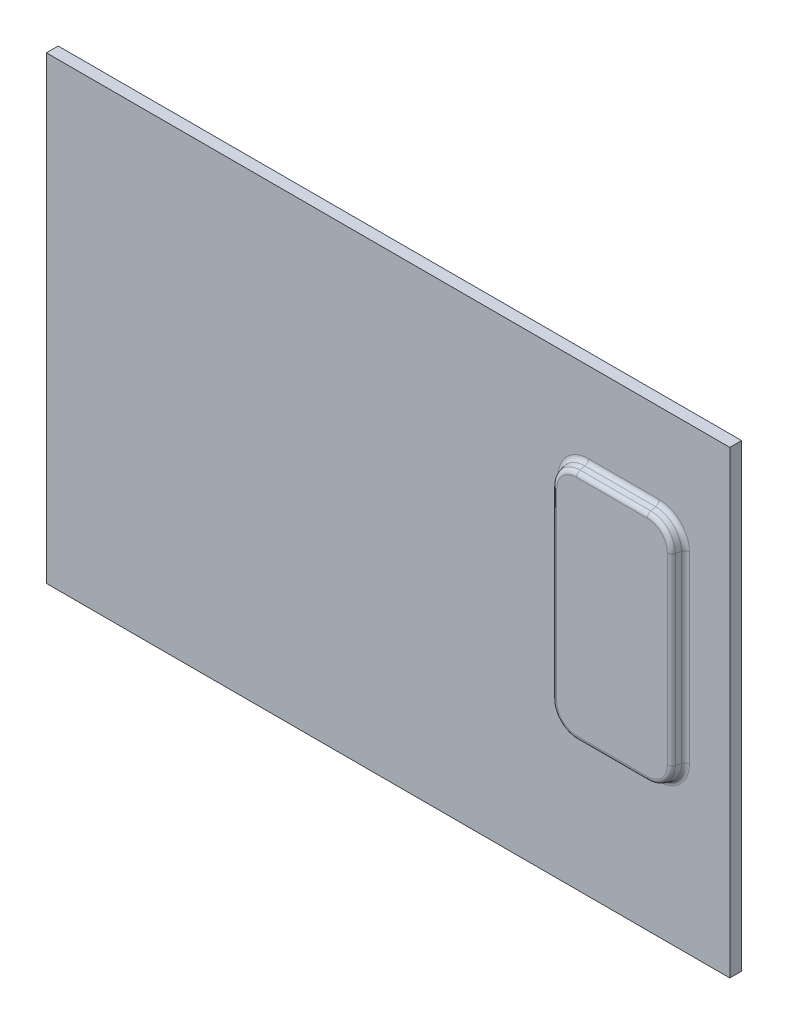
ISO-10303-21;
HEADER;
FILE_DESCRIPTION(('STEP AP214'),'2;1');
FILE_NAME('part.step','',(''),(''),'','','');
FILE_SCHEMA(('AUTOMOTIVE_DESIGN { 1 0 10303 214 1 1 1 1 }'));
ENDSEC;
DATA;
#1=APPLICATION_CONTEXT('core data for automotive mechanical design processes');
#2=APPLICATION_PROTOCOL_DEFINITION('international standard','automotive_design',2000,#1);
#3=PRODUCT_CONTEXT('',#1,'mechanical');
#4=PRODUCT('Part','Part','',(#3));
#5=PRODUCT_RELATED_PRODUCT_CATEGORY('part','',(#4));
#6=PRODUCT_DEFINITION_FORMATION('','',#4);
#7=PRODUCT_DEFINITION_CONTEXT('part definition',#1,'design');
#8=PRODUCT_DEFINITION('design','',#6,#7);
#9=PRODUCT_DEFINITION_SHAPE('','',#8);
#10=(LENGTH_UNIT() NAMED_UNIT(*) SI_UNIT(.MILLI.,.METRE.));
#11=(NAMED_UNIT(*) PLANE_ANGLE_UNIT() SI_UNIT($,.RADIAN.));
#12=(NAMED_UNIT(*) SI_UNIT($,.STERADIAN.) SOLID_ANGLE_UNIT());
#13=UNCERTAINTY_MEASURE_WITH_UNIT(LENGTH_MEASURE(1.E-05),#10,'distance_accuracy_value','');
#14=(GEOMETRIC_REPRESENTATION_CONTEXT(3) GLOBAL_UNCERTAINTY_ASSIGNED_CONTEXT((#13)) GLOBAL_UNIT_ASSIGNED_CONTEXT((#10,
#11,#12)) REPRESENTATION_CONTEXT('',''));
#15=CARTESIAN_POINT('',(0.,0.,0.));
#16=DIRECTION('',(0.,0.,1.));
#17=DIRECTION('',(1.,0.,0.));
#18=AXIS2_PLACEMENT_3D('',#15,#16,#17);
#19=CARTESIAN_POINT('',(0.,0.,5.));
#20=DIRECTION('',(0.,0.,1.));
#21=DIRECTION('',(1.,0.,0.));
#22=AXIS2_PLACEMENT_3D('',#19,#20,#21);
#23=PLANE('',#22);
#24=DIRECTION('',(0.,-1.,0.));
#25=VECTOR('',#24,1.);
#26=CARTESIAN_POINT('',(127.874399938114,0.,5.));
#27=LINE('',#26,#25);
#28=CARTESIAN_POINT('',(127.874399938114,50.5,5.));
#29=VERTEX_POINT('',#28);
#30=CARTESIAN_POINT('',(127.874399938114,-27.5,5.));
#31=VERTEX_POINT('',#30);
#32=EDGE_CURVE('E229',#29,#31,#27,.T.);
#33=ORIENTED_EDGE('',*,*,#32,.T.);
#34=CARTESIAN_POINT('',(115.,-27.5,5.));
#35=DIRECTION('',(0.,0.,1.));
#36=DIRECTION('',(1.,0.,0.));
#37=AXIS2_PLACEMENT_3D('',#34,#35,#36);
#38=CIRCLE('',#37,12.8743999381135);
#39=CARTESIAN_POINT('',(115.,-40.3743999381135,5.));
#40=VERTEX_POINT('',#39);
#41=EDGE_CURVE('E243',#31,#40,#38,.F.);
#42=ORIENTED_EDGE('',*,*,#41,.T.);
#43=DIRECTION('',(-1.,0.,0.));
#44=VECTOR('',#43,1.);
#45=CARTESIAN_POINT('',(0.,-40.3743999381135,5.));
#46=LINE('',#45,#44);
#47=CARTESIAN_POINT('',(85.0000000000001,-40.3743999381135,5.));
#48=VERTEX_POINT('',#47);
#49=EDGE_CURVE('E241',#40,#48,#46,.T.);
#50=ORIENTED_EDGE('',*,*,#49,.T.);
#51=CARTESIAN_POINT('',(85.0000000000001,-27.5,5.));
#52=DIRECTION('',(0.,0.,1.));
#53=DIRECTION('',(1.,0.,0.));
#54=AXIS2_PLACEMENT_3D('',#51,#52,#53);
#55=CIRCLE('',#54,12.8743999381135);
#56=CARTESIAN_POINT('',(72.1256000618865,-27.5,5.));
#57=VERTEX_POINT('',#56);
#58=EDGE_CURVE('E239',#48,#57,#55,.F.);
#59=ORIENTED_EDGE('',*,*,#58,.T.);
#60=DIRECTION('',(0.,1.,0.));
#61=VECTOR('',#60,1.);
#62=CARTESIAN_POINT('',(72.1256000618865,0.,5.));
#63=LINE('',#62,#61);
#64=CARTESIAN_POINT('',(72.1256000618865,50.5,5.));
#65=VERTEX_POINT('',#64);
#66=EDGE_CURVE('E237',#57,#65,#63,.T.);
#67=ORIENTED_EDGE('',*,*,#66,.T.);
#68=CARTESIAN_POINT('',(85.0000000000001,50.5,5.));
#69=DIRECTION('',(0.,0.,1.));
#70=DIRECTION('',(1.,0.,0.));
#71=AXIS2_PLACEMENT_3D('',#68,#69,#70);
#72=CIRCLE('',#71,12.8743999381135);
#73=CARTESIAN_POINT('',(85.0000000000001,63.3743999381136,5.));
#74=VERTEX_POINT('',#73);
#75=EDGE_CURVE('E235',#65,#74,#72,.F.);
#76=ORIENTED_EDGE('',*,*,#75,.T.);
#77=DIRECTION('',(1.,0.,0.));
#78=VECTOR('',#77,1.);
#79=CARTESIAN_POINT('',(0.,63.3743999381136,5.));
#80=LINE('',#79,#78);
#81=CARTESIAN_POINT('',(115.,63.3743999381136,5.));
#82=VERTEX_POINT('',#81);
#83=EDGE_CURVE('E233',#74,#82,#80,.T.);
#84=ORIENTED_EDGE('',*,*,#83,.T.);
#85=CARTESIAN_POINT('',(115.,50.5,5.));
#86=DIRECTION('',(0.,0.,1.));
#87=DIRECTION('',(1.,0.,0.));
#88=AXIS2_PLACEMENT_3D('',#85,#86,#87);
#89=CIRCLE('',#88,12.8743999381135);
#90=EDGE_CURVE('E231',#82,#29,#89,.F.);
#91=ORIENTED_EDGE('',*,*,#90,.T.);
#92=EDGE_LOOP('',(#33,#42,#50,#59,#67,#76,#84,#91));
#93=FACE_BOUND('',#92,.T.);
#94=DIRECTION('',(0.,-1.,0.));
#95=VECTOR('',#94,1.);
#96=CARTESIAN_POINT('',(-145.,-97.5,5.));
#97=LINE('',#96,#95);
#98=CARTESIAN_POINT('',(-145.,97.5,5.));
#99=VERTEX_POINT('',#98);
#100=CARTESIAN_POINT('',(-145.,-97.5,5.));
#101=VERTEX_POINT('',#100);
#102=EDGE_CURVE('E187',#99,#101,#97,.T.);
#103=ORIENTED_EDGE('',*,*,#102,.T.);
#104=DIRECTION('',(1.,0.,0.));
#105=VECTOR('',#104,1.);
#106=CARTESIAN_POINT('',(145.,-97.5,5.));
#107=LINE('',#106,#105);
#108=CARTESIAN_POINT('',(145.,-97.5,5.));
#109=VERTEX_POINT('',#108);
#110=EDGE_CURVE('E176',#101,#109,#107,.T.);
#111=ORIENTED_EDGE('',*,*,#110,.T.);
#112=DIRECTION('',(0.,1.,0.));
#113=VECTOR('',#112,1.);
#114=CARTESIAN_POINT('',(145.,-97.5,5.));
#115=LINE('',#114,#113);
#116=CARTESIAN_POINT('',(145.,97.5,5.));
#117=VERTEX_POINT('',#116);
#118=EDGE_CURVE('E186',#109,#117,#115,.T.);
#119=ORIENTED_EDGE('',*,*,#118,.T.);
#120=DIRECTION('',(-1.,0.,0.));
#121=VECTOR('',#120,1.);
#122=CARTESIAN_POINT('',(145.,97.5,5.));
#123=LINE('',#122,#121);
#124=EDGE_CURVE('E191',#117,#99,#123,.T.);
#125=ORIENTED_EDGE('',*,*,#124,.T.);
#126=EDGE_LOOP('',(#103,#111,#119,#125));
#127=FACE_BOUND('',#126,.T.);
#128=ADVANCED_FACE('F38',(#93,#127),#23,.T.);
#129=CARTESIAN_POINT('',(-145.,-97.5,5.));
#130=DIRECTION('',(1.,0.,0.));
#131=DIRECTION('',(0.,0.,-1.));
#132=AXIS2_PLACEMENT_3D('',#129,#130,#131);
#133=PLANE('',#132);
#134=DIRECTION('',(0.,-1.,0.));
#135=VECTOR('',#134,1.);
#136=CARTESIAN_POINT('',(-145.,-97.5,0.));
#137=LINE('',#136,#135);
#138=CARTESIAN_POINT('',(-145.,97.5,0.));
#139=VERTEX_POINT('',#138);
#140=CARTESIAN_POINT('',(-145.,-97.5,0.));
#141=VERTEX_POINT('',#140);
#142=EDGE_CURVE('E199',#139,#141,#137,.T.);
#143=ORIENTED_EDGE('',*,*,#142,.T.);
#144=DIRECTION('',(0.,0.,-1.));
#145=VECTOR('',#144,1.);
#146=CARTESIAN_POINT('',(-145.,-97.5,5.));
#147=LINE('',#146,#145);
#148=EDGE_CURVE('E180',#101,#141,#147,.T.);
#149=ORIENTED_EDGE('',*,*,#148,.F.);
#150=ORIENTED_EDGE('',*,*,#102,.F.);
#151=DIRECTION('',(0.,0.,-1.));
#152=VECTOR('',#151,1.);
#153=CARTESIAN_POINT('',(-145.,97.5,5.));
#154=LINE('',#153,#152);
#155=EDGE_CURVE('E753',#99,#139,#154,.T.);
#156=ORIENTED_EDGE('',*,*,#155,.T.);
#157=EDGE_LOOP('',(#143,#149,#150,#156));
#158=FACE_BOUND('',#157,.T.);
#159=ADVANCED_FACE('F197',(#158),#133,.F.);
#160=CARTESIAN_POINT('',(145.,-97.5,5.));
#161=DIRECTION('',(0.,1.,0.));
#162=DIRECTION('',(-1.,0.,0.));
#163=AXIS2_PLACEMENT_3D('',#160,#161,#162);
#164=PLANE('',#163);
#165=DIRECTION('',(1.,0.,0.));
#166=VECTOR('',#165,1.);
#167=CARTESIAN_POINT('',(145.,-97.5,0.));
#168=LINE('',#167,#166);
#169=CARTESIAN_POINT('',(145.,-97.5,0.));
#170=VERTEX_POINT('',#169);
#171=EDGE_CURVE('E751',#141,#170,#168,.T.);
#172=ORIENTED_EDGE('',*,*,#171,.T.);
#173=DIRECTION('',(0.,0.,-1.));
#174=VECTOR('',#173,1.);
#175=CARTESIAN_POINT('',(145.,-97.5,5.));
#176=LINE('',#175,#174);
#177=EDGE_CURVE('E183',#109,#170,#176,.T.);
#178=ORIENTED_EDGE('',*,*,#177,.F.);
#179=ORIENTED_EDGE('',*,*,#110,.F.);
#180=ORIENTED_EDGE('',*,*,#148,.T.);
#181=EDGE_LOOP('',(#172,#178,#179,#180));
#182=FACE_BOUND('',#181,.T.);
#183=ADVANCED_FACE('F178',(#182),#164,.F.);
#184=CARTESIAN_POINT('',(145.,-97.5,5.));
#185=DIRECTION('',(-1.,0.,0.));
#186=DIRECTION('',(0.,0.,1.));
#187=AXIS2_PLACEMENT_3D('',#184,#185,#186);
#188=PLANE('',#187);
#189=DIRECTION('',(0.,1.,0.));
#190=VECTOR('',#189,1.);
#191=CARTESIAN_POINT('',(145.,-97.5,0.));
#192=LINE('',#191,#190);
#193=CARTESIAN_POINT('',(145.,97.5,0.));
#194=VERTEX_POINT('',#193);
#195=EDGE_CURVE('E748',#170,#194,#192,.T.);
#196=ORIENTED_EDGE('',*,*,#195,.T.);
#197=DIRECTION('',(0.,0.,-1.));
#198=VECTOR('',#197,1.);
#199=CARTESIAN_POINT('',(145.,97.5,5.));
#200=LINE('',#199,#198);
#201=EDGE_CURVE('E205',#117,#194,#200,.T.);
#202=ORIENTED_EDGE('',*,*,#201,.F.);
#203=ORIENTED_EDGE('',*,*,#118,.F.);
#204=ORIENTED_EDGE('',*,*,#177,.T.);
#205=EDGE_LOOP('',(#196,#202,#203,#204));
#206=FACE_BOUND('',#205,.T.);
#207=ADVANCED_FACE('F455',(#206),#188,.F.);
#208=CARTESIAN_POINT('',(145.,97.5,5.));
#209=DIRECTION('',(0.,-1.,0.));
#210=DIRECTION('',(1.,0.,0.));
#211=AXIS2_PLACEMENT_3D('',#208,#209,#210);
#212=PLANE('',#211);
#213=DIRECTION('',(-1.,0.,0.));
#214=VECTOR('',#213,1.);
#215=CARTESIAN_POINT('',(145.,97.5,0.));
#216=LINE('',#215,#214);
#217=EDGE_CURVE('E195',#194,#139,#216,.T.);
#218=ORIENTED_EDGE('',*,*,#217,.T.);
#219=ORIENTED_EDGE('',*,*,#155,.F.);
#220=ORIENTED_EDGE('',*,*,#124,.F.);
#221=ORIENTED_EDGE('',*,*,#201,.T.);
#222=EDGE_LOOP('',(#218,#219,#220,#221));
#223=FACE_BOUND('',#222,.T.);
#224=ADVANCED_FACE('F451',(#223),#212,.F.);
#225=CARTESIAN_POINT('',(0.,0.,0.));
#226=DIRECTION('',(0.,0.,1.));
#227=DIRECTION('',(1.,0.,0.));
#228=AXIS2_PLACEMENT_3D('',#225,#226,#227);
#229=PLANE('',#228);
#230=ORIENTED_EDGE('',*,*,#142,.F.);
#231=ORIENTED_EDGE('',*,*,#217,.F.);
#232=ORIENTED_EDGE('',*,*,#195,.F.);
#233=ORIENTED_EDGE('',*,*,#171,.F.);
#234=EDGE_LOOP('',(#230,#231,#232,#233));
#235=FACE_BOUND('',#234,.T.);
#236=ADVANCED_FACE('F448',(#235),#229,.F.);
#237=CARTESIAN_POINT('',(125.,60.5,10.));
#238=DIRECTION('',(0.965925826289068,0.,0.258819045102521));
#239=DIRECTION('',(0.258819045102521,0.,-0.965925826289068));
#240=AXIS2_PLACEMENT_3D('',#237,#238,#239);
#241=PLANE('',#240);
#242=DIRECTION('',(0.258819045102521,0.,-0.965925826289068));
#243=VECTOR('',#242,1.);
#244=CARTESIAN_POINT('',(125.,-27.5,10.));
#245=LINE('',#244,#243);
#246=CARTESIAN_POINT('',(125.39719767662,-27.5,8.51763809020504));
#247=VERTEX_POINT('',#246);
#248=CARTESIAN_POINT('',(125.942548285535,-27.5,6.48236190979495));
#249=VERTEX_POINT('',#248);
#250=EDGE_CURVE('E216',#247,#249,#245,.T.);
#251=ORIENTED_EDGE('',*,*,#250,.T.);
#252=DIRECTION('',(0.,1.,0.));
#253=VECTOR('',#252,1.);
#254=CARTESIAN_POINT('',(125.942548285535,60.5,6.48236190979496));
#255=LINE('',#254,#253);
#256=CARTESIAN_POINT('',(125.942548285535,50.5,6.48236190979496));
#257=VERTEX_POINT('',#256);
#258=EDGE_CURVE('E12',#249,#257,#255,.T.);
#259=ORIENTED_EDGE('',*,*,#258,.T.);
#260=DIRECTION('',(0.258819045102521,0.,-0.965925826289068));
#261=VECTOR('',#260,1.);
#262=CARTESIAN_POINT('',(125.,50.5,10.));
#263=LINE('',#262,#261);
#264=CARTESIAN_POINT('',(125.39719767662,50.5,8.51763809020504));
#265=VERTEX_POINT('',#264);
#266=EDGE_CURVE('E219',#257,#265,#263,.F.);
#267=ORIENTED_EDGE('',*,*,#266,.T.);
#268=DIRECTION('',(0.,1.,0.));
#269=VECTOR('',#268,1.);
#270=CARTESIAN_POINT('',(125.39719767662,-27.5,8.51763809020504));
#271=LINE('',#270,#269);
#272=EDGE_CURVE('E47',#265,#247,#271,.F.);
#273=ORIENTED_EDGE('',*,*,#272,.T.);
#274=EDGE_LOOP('',(#251,#259,#267,#273));
#275=FACE_BOUND('',#274,.T.);
#276=ADVANCED_FACE('F408',(#275),#241,.T.);
#277=CARTESIAN_POINT('',(75.0000000000001,60.5,10.));
#278=DIRECTION('',(0.,0.965925826289068,0.258819045102521));
#279=DIRECTION('',(0.,-0.258819045102521,0.965925826289068));
#280=AXIS2_PLACEMENT_3D('',#277,#278,#279);
#281=PLANE('',#280);
#282=DIRECTION('',(0.,0.258819045102521,-0.965925826289068));
#283=VECTOR('',#282,1.);
#284=CARTESIAN_POINT('',(115.,60.5,10.));
#285=LINE('',#284,#283);
#286=CARTESIAN_POINT('',(115.,60.8971976766202,8.51763809020504));
#287=VERTEX_POINT('',#286);
#288=CARTESIAN_POINT('',(115.,61.4425482855354,6.48236190979496));
#289=VERTEX_POINT('',#288);
#290=EDGE_CURVE('E203',#287,#289,#285,.T.);
#291=ORIENTED_EDGE('',*,*,#290,.T.);
#292=DIRECTION('',(-1.,0.,0.));
#293=VECTOR('',#292,1.);
#294=CARTESIAN_POINT('',(75.0000000000001,61.4425482855354,6.48236190979496));
#295=LINE('',#294,#293);
#296=CARTESIAN_POINT('',(85.0000000000001,61.4425482855354,6.48236190979496));
#297=VERTEX_POINT('',#296);
#298=EDGE_CURVE('E270',#289,#297,#295,.T.);
#299=ORIENTED_EDGE('',*,*,#298,.T.);
#300=DIRECTION('',(0.,0.258819045102521,-0.965925826289068));
#301=VECTOR('',#300,1.);
#302=CARTESIAN_POINT('',(85.0000000000001,60.5,10.));
#303=LINE('',#302,#301);
#304=CARTESIAN_POINT('',(85.0000000000001,60.8971976766202,8.51763809020504));
#305=VERTEX_POINT('',#304);
#306=EDGE_CURVE('E200',#297,#305,#303,.F.);
#307=ORIENTED_EDGE('',*,*,#306,.T.);
#308=DIRECTION('',(-1.,0.,0.));
#309=VECTOR('',#308,1.);
#310=CARTESIAN_POINT('',(115.,60.8971976766202,8.51763809020504));
#311=LINE('',#310,#309);
#312=EDGE_CURVE('E268',#305,#287,#311,.F.);
#313=ORIENTED_EDGE('',*,*,#312,.T.);
#314=EDGE_LOOP('',(#291,#299,#307,#313));
#315=FACE_BOUND('',#314,.T.);
#316=ADVANCED_FACE('F350',(#315),#281,.T.);
#317=CARTESIAN_POINT('',(75.0000000000001,60.5,10.));
#318=DIRECTION('',(-0.965925826289068,0.,0.258819045102521));
#319=DIRECTION('',(0.258819045102521,0.,0.965925826289068));
#320=AXIS2_PLACEMENT_3D('',#317,#318,#319);
#321=PLANE('',#320);
#322=DIRECTION('',(-0.258819045102521,0.,-0.965925826289068));
#323=VECTOR('',#322,1.);
#324=CARTESIAN_POINT('',(75.0000000000001,50.5,10.));
#325=LINE('',#324,#323);
#326=CARTESIAN_POINT('',(74.6028023233799,50.5,8.51763809020504));
#327=VERTEX_POINT('',#326);
#328=CARTESIAN_POINT('',(74.0574517144647,50.5,6.48236190979496));
#329=VERTEX_POINT('',#328);
#330=EDGE_CURVE('E209',#327,#329,#325,.T.);
#331=ORIENTED_EDGE('',*,*,#330,.T.);
#332=DIRECTION('',(0.,-1.,0.));
#333=VECTOR('',#332,1.);
#334=CARTESIAN_POINT('',(74.0574517144647,60.5,6.48236190979495));
#335=LINE('',#334,#333);
#336=CARTESIAN_POINT('',(74.0574517144647,-27.5,6.48236190979495));
#337=VERTEX_POINT('',#336);
#338=EDGE_CURVE('E262',#329,#337,#335,.T.);
#339=ORIENTED_EDGE('',*,*,#338,.T.);
#340=DIRECTION('',(-0.258819045102521,0.,-0.965925826289068));
#341=VECTOR('',#340,1.);
#342=CARTESIAN_POINT('',(75.0000000000001,-27.5,10.));
#343=LINE('',#342,#341);
#344=CARTESIAN_POINT('',(74.6028023233799,-27.5,8.51763809020504));
#345=VERTEX_POINT('',#344);
#346=EDGE_CURVE('E213',#337,#345,#343,.F.);
#347=ORIENTED_EDGE('',*,*,#346,.T.);
#348=DIRECTION('',(0.,-1.,0.));
#349=VECTOR('',#348,1.);
#350=CARTESIAN_POINT('',(74.6028023233799,50.5,8.51763809020504));
#351=LINE('',#350,#349);
#352=EDGE_CURVE('E260',#345,#327,#351,.F.);
#353=ORIENTED_EDGE('',*,*,#352,.T.);
#354=EDGE_LOOP('',(#331,#339,#347,#353));
#355=FACE_BOUND('',#354,.T.);
#356=ADVANCED_FACE('F373',(#355),#321,.T.);
#357=CARTESIAN_POINT('',(75.0000000000001,-37.5,10.));
#358=DIRECTION('',(0.,-0.965925826289068,0.258819045102521));
#359=DIRECTION('',(0.,-0.258819045102521,-0.965925826289068));
#360=AXIS2_PLACEMENT_3D('',#357,#358,#359);
#361=PLANE('',#360);
#362=DIRECTION('',(0.,-0.258819045102521,-0.965925826289068));
#363=VECTOR('',#362,1.);
#364=CARTESIAN_POINT('',(85.0000000000001,-37.5,10.));
#365=LINE('',#364,#363);
#366=CARTESIAN_POINT('',(85.0000000000001,-37.8971976766202,8.51763809020504));
#367=VERTEX_POINT('',#366);
#368=CARTESIAN_POINT('',(85.0000000000001,-38.4425482855354,6.48236190979496));
#369=VERTEX_POINT('',#368);
#370=EDGE_CURVE('E212',#367,#369,#365,.T.);
#371=ORIENTED_EDGE('',*,*,#370,.T.);
#372=DIRECTION('',(1.,0.,0.));
#373=VECTOR('',#372,1.);
#374=CARTESIAN_POINT('',(75.0000000000001,-38.4425482855354,6.48236190979496));
#375=LINE('',#374,#373);
#376=CARTESIAN_POINT('',(115.,-38.4425482855354,6.48236190979495));
#377=VERTEX_POINT('',#376);
#378=EDGE_CURVE('E254',#369,#377,#375,.T.);
#379=ORIENTED_EDGE('',*,*,#378,.T.);
#380=DIRECTION('',(0.,-0.258819045102521,-0.965925826289068));
#381=VECTOR('',#380,1.);
#382=CARTESIAN_POINT('',(115.,-37.5,10.));
#383=LINE('',#382,#381);
#384=CARTESIAN_POINT('',(115.,-37.8971976766202,8.51763809020504));
#385=VERTEX_POINT('',#384);
#386=EDGE_CURVE('E222',#377,#385,#383,.F.);
#387=ORIENTED_EDGE('',*,*,#386,.T.);
#388=DIRECTION('',(1.,0.,0.));
#389=VECTOR('',#388,1.);
#390=CARTESIAN_POINT('',(85.0000000000001,-37.8971976766202,8.51763809020504));
#391=LINE('',#390,#389);
#392=EDGE_CURVE('E252',#385,#367,#391,.F.);
#393=ORIENTED_EDGE('',*,*,#392,.T.);
#394=EDGE_LOOP('',(#371,#379,#387,#393));
#395=FACE_BOUND('',#394,.T.);
#396=ADVANCED_FACE('F394',(#395),#361,.T.);
#397=CARTESIAN_POINT('',(0.,0.,10.));
#398=DIRECTION('',(0.,0.,1.));
#399=DIRECTION('',(1.,0.,0.));
#400=AXIS2_PLACEMENT_3D('',#397,#398,#399);
#401=PLANE('',#400);
#402=DIRECTION('',(-1.,0.,0.));
#403=VECTOR('',#402,1.);
#404=CARTESIAN_POINT('',(115.,-35.9653460240421,10.));
#405=LINE('',#404,#403);
#406=CARTESIAN_POINT('',(85.0000000000001,-35.965346024042,10.));
#407=VERTEX_POINT('',#406);
#408=CARTESIAN_POINT('',(115.,-35.9653460240421,10.));
#409=VERTEX_POINT('',#408);
#410=EDGE_CURVE('E55',#407,#409,#405,.F.);
#411=ORIENTED_EDGE('',*,*,#410,.T.);
#412=CARTESIAN_POINT('',(115.,-27.5,10.));
#413=DIRECTION('',(0.,0.,1.));
#414=DIRECTION('',(1.,0.,0.));
#415=AXIS2_PLACEMENT_3D('',#412,#413,#414);
#416=CIRCLE('',#415,8.46534602404208);
#417=CARTESIAN_POINT('',(123.465346024042,-27.5,10.));
#418=VERTEX_POINT('',#417);
#419=EDGE_CURVE('E288',#409,#418,#416,.T.);
#420=ORIENTED_EDGE('',*,*,#419,.T.);
#421=DIRECTION('',(0.,-1.,0.));
#422=VECTOR('',#421,1.);
#423=CARTESIAN_POINT('',(123.465346024042,50.5,10.));
#424=LINE('',#423,#422);
#425=CARTESIAN_POINT('',(123.465346024042,50.5,10.));
#426=VERTEX_POINT('',#425);
#427=EDGE_CURVE('E276',#418,#426,#424,.F.);
#428=ORIENTED_EDGE('',*,*,#427,.T.);
#429=CARTESIAN_POINT('',(115.,50.5,10.));
#430=DIRECTION('',(0.,0.,1.));
#431=DIRECTION('',(1.,0.,0.));
#432=AXIS2_PLACEMENT_3D('',#429,#430,#431);
#433=CIRCLE('',#432,8.46534602404208);
#434=CARTESIAN_POINT('',(115.,58.9653460240421,10.));
#435=VERTEX_POINT('',#434);
#436=EDGE_CURVE('E278',#426,#435,#433,.T.);
#437=ORIENTED_EDGE('',*,*,#436,.T.);
#438=DIRECTION('',(1.,0.,0.));
#439=VECTOR('',#438,1.);
#440=CARTESIAN_POINT('',(85.,58.9653460240421,10.));
#441=LINE('',#440,#439);
#442=CARTESIAN_POINT('',(85.0000000000001,58.9653460240421,10.));
#443=VERTEX_POINT('',#442);
#444=EDGE_CURVE('E280',#435,#443,#441,.F.);
#445=ORIENTED_EDGE('',*,*,#444,.T.);
#446=CARTESIAN_POINT('',(85.0000000000001,50.5,10.));
#447=DIRECTION('',(0.,0.,1.));
#448=DIRECTION('',(1.,0.,0.));
#449=AXIS2_PLACEMENT_3D('',#446,#447,#448);
#450=CIRCLE('',#449,8.46534602404208);
#451=CARTESIAN_POINT('',(76.534653975958,50.5,10.));
#452=VERTEX_POINT('',#451);
#453=EDGE_CURVE('E282',#443,#452,#450,.T.);
#454=ORIENTED_EDGE('',*,*,#453,.T.);
#455=DIRECTION('',(0.,1.,0.));
#456=VECTOR('',#455,1.);
#457=CARTESIAN_POINT('',(76.534653975958,-27.5,10.));
#458=LINE('',#457,#456);
#459=CARTESIAN_POINT('',(76.534653975958,-27.5,10.));
#460=VERTEX_POINT('',#459);
#461=EDGE_CURVE('E284',#452,#460,#458,.F.);
#462=ORIENTED_EDGE('',*,*,#461,.T.);
#463=CARTESIAN_POINT('',(85.0000000000001,-27.5,10.));
#464=DIRECTION('',(0.,0.,1.));
#465=DIRECTION('',(1.,0.,0.));
#466=AXIS2_PLACEMENT_3D('',#463,#464,#465);
#467=CIRCLE('',#466,8.46534602404208);
#468=EDGE_CURVE('E60',#460,#407,#467,.T.);
#469=ORIENTED_EDGE('',*,*,#468,.T.);
#470=EDGE_LOOP('',(#411,#420,#428,#437,#445,#454,#462,#469));
#471=FACE_BOUND('',#470,.T.);
#472=ADVANCED_FACE('F447',(#471),#401,.T.);
#473=CARTESIAN_POINT('',(115.,50.5,10.));
#474=DIRECTION('',(0.,0.,-1.));
#475=DIRECTION('',(1.,0.,0.));
#476=AXIS2_PLACEMENT_3D('',#473,#474,#475);
#477=CONICAL_SURFACE('',#476,10.,0.26179938779915);
#478=ORIENTED_EDGE('',*,*,#266,.F.);
#479=CARTESIAN_POINT('',(115.,50.5,6.48236190979496));
#480=DIRECTION('',(0.,0.,-1.));
#481=DIRECTION('',(-1.,0.,0.));
#482=AXIS2_PLACEMENT_3D('',#479,#480,#481);
#483=CIRCLE('',#482,10.9425482855354);
#484=EDGE_CURVE('E274',#257,#289,#483,.F.);
#485=ORIENTED_EDGE('',*,*,#484,.T.);
#486=ORIENTED_EDGE('',*,*,#290,.F.);
#487=CARTESIAN_POINT('',(115.,50.5,8.51763809020505));
#488=DIRECTION('',(0.,0.,1.));
#489=DIRECTION('',(1.,0.,0.));
#490=AXIS2_PLACEMENT_3D('',#487,#488,#489);
#491=CIRCLE('',#490,10.3971976766202);
#492=EDGE_CURVE('E272',#287,#265,#491,.F.);
#493=ORIENTED_EDGE('',*,*,#492,.T.);
#494=EDGE_LOOP('',(#478,#485,#486,#493));
#495=FACE_BOUND('',#494,.T.);
#496=ADVANCED_FACE('F411',(#495),#477,.T.);
#497=CARTESIAN_POINT('',(85.0000000000001,50.5,10.));
#498=DIRECTION('',(0.,0.,-1.));
#499=DIRECTION('',(1.,0.,0.));
#500=AXIS2_PLACEMENT_3D('',#497,#498,#499);
#501=CONICAL_SURFACE('',#500,10.,0.26179938779915);
#502=ORIENTED_EDGE('',*,*,#306,.F.);
#503=CARTESIAN_POINT('',(85.0000000000001,50.5,6.48236190979496));
#504=DIRECTION('',(0.,0.,-1.));
#505=DIRECTION('',(-1.,0.,0.));
#506=AXIS2_PLACEMENT_3D('',#503,#504,#505);
#507=CIRCLE('',#506,10.9425482855354);
#508=EDGE_CURVE('E266',#297,#329,#507,.F.);
#509=ORIENTED_EDGE('',*,*,#508,.T.);
#510=ORIENTED_EDGE('',*,*,#330,.F.);
#511=CARTESIAN_POINT('',(85.0000000000001,50.5,8.51763809020505));
#512=DIRECTION('',(0.,0.,1.));
#513=DIRECTION('',(1.,0.,0.));
#514=AXIS2_PLACEMENT_3D('',#511,#512,#513);
#515=CIRCLE('',#514,10.3971976766202);
#516=EDGE_CURVE('E264',#327,#305,#515,.F.);
#517=ORIENTED_EDGE('',*,*,#516,.T.);
#518=EDGE_LOOP('',(#502,#509,#510,#517));
#519=FACE_BOUND('',#518,.T.);
#520=ADVANCED_FACE('F347',(#519),#501,.T.);
#521=CARTESIAN_POINT('',(115.,-27.5,10.));
#522=DIRECTION('',(0.,0.,-1.));
#523=DIRECTION('',(1.,0.,0.));
#524=AXIS2_PLACEMENT_3D('',#521,#522,#523);
#525=CONICAL_SURFACE('',#524,10.,0.26179938779915);
#526=ORIENTED_EDGE('',*,*,#386,.F.);
#527=CARTESIAN_POINT('',(115.,-27.5,6.48236190979496));
#528=DIRECTION('',(0.,0.,-1.));
#529=DIRECTION('',(-1.,0.,0.));
#530=AXIS2_PLACEMENT_3D('',#527,#528,#529);
#531=CIRCLE('',#530,10.9425482855354);
#532=EDGE_CURVE('E249',#377,#249,#531,.F.);
#533=ORIENTED_EDGE('',*,*,#532,.T.);
#534=ORIENTED_EDGE('',*,*,#250,.F.);
#535=CARTESIAN_POINT('',(115.,-27.5,8.51763809020505));
#536=DIRECTION('',(0.,0.,1.));
#537=DIRECTION('',(1.,0.,0.));
#538=AXIS2_PLACEMENT_3D('',#535,#536,#537);
#539=CIRCLE('',#538,10.3971976766202);
#540=EDGE_CURVE('E246',#247,#385,#539,.F.);
#541=ORIENTED_EDGE('',*,*,#540,.T.);
#542=EDGE_LOOP('',(#526,#533,#534,#541));
#543=FACE_BOUND('',#542,.T.);
#544=ADVANCED_FACE('F397',(#543),#525,.T.);
#545=CARTESIAN_POINT('',(85.0000000000001,-27.5,10.));
#546=DIRECTION('',(0.,0.,-1.));
#547=DIRECTION('',(1.,0.,0.));
#548=AXIS2_PLACEMENT_3D('',#545,#546,#547);
#549=CONICAL_SURFACE('',#548,10.,0.26179938779915);
#550=ORIENTED_EDGE('',*,*,#346,.F.);
#551=CARTESIAN_POINT('',(85.0000000000001,-27.5,6.48236190979496));
#552=DIRECTION('',(0.,0.,-1.));
#553=DIRECTION('',(-1.,0.,0.));
#554=AXIS2_PLACEMENT_3D('',#551,#552,#553);
#555=CIRCLE('',#554,10.9425482855354);
#556=EDGE_CURVE('E258',#337,#369,#555,.F.);
#557=ORIENTED_EDGE('',*,*,#556,.T.);
#558=ORIENTED_EDGE('',*,*,#370,.F.);
#559=CARTESIAN_POINT('',(85.0000000000001,-27.5,8.51763809020505));
#560=DIRECTION('',(0.,0.,1.));
#561=DIRECTION('',(1.,0.,0.));
#562=AXIS2_PLACEMENT_3D('',#559,#560,#561);
#563=CIRCLE('',#562,10.3971976766202);
#564=EDGE_CURVE('E256',#367,#345,#563,.F.);
#565=ORIENTED_EDGE('',*,*,#564,.T.);
#566=EDGE_LOOP('',(#550,#557,#558,#565));
#567=FACE_BOUND('',#566,.T.);
#568=ADVANCED_FACE('F377',(#567),#549,.T.);
#569=CARTESIAN_POINT('',(85.0000000000001,50.5,7.));
#570=DIRECTION('',(0.,0.,1.));
#571=DIRECTION('',(1.,0.,0.));
#572=AXIS2_PLACEMENT_3D('',#569,#570,#571);
#573=TOROIDAL_SURFACE('',#572,12.8743999381135,2.);
#574=CARTESIAN_POINT('',(72.1256000618865,50.5,7.));
#575=DIRECTION('',(0.,1.,0.));
#576=DIRECTION('',(0.,0.,1.));
#577=AXIS2_PLACEMENT_3D('',#574,#575,#576);
#578=CIRCLE('',#577,2.);
#579=EDGE_CURVE('E307',#329,#65,#578,.T.);
#580=ORIENTED_EDGE('',*,*,#579,.F.);
#581=ORIENTED_EDGE('',*,*,#508,.F.);
#582=CARTESIAN_POINT('',(85.0000000000001,63.3743999381136,7.));
#583=DIRECTION('',(-1.,0.,0.));
#584=DIRECTION('',(0.,0.,1.));
#585=AXIS2_PLACEMENT_3D('',#582,#583,#584);
#586=CIRCLE('',#585,2.);
#587=EDGE_CURVE('E310',#74,#297,#586,.T.);
#588=ORIENTED_EDGE('',*,*,#587,.F.);
#589=ORIENTED_EDGE('',*,*,#75,.F.);
#590=EDGE_LOOP('',(#580,#581,#588,#589));
#591=FACE_BOUND('',#590,.T.);
#592=ADVANCED_FACE('F370',(#591),#573,.F.);
#593=CARTESIAN_POINT('',(75.0000000000001,63.3743999381136,7.));
#594=DIRECTION('',(1.,0.,0.));
#595=DIRECTION('',(0.,0.,-1.));
#596=AXIS2_PLACEMENT_3D('',#593,#594,#595);
#597=CYLINDRICAL_SURFACE('',#596,2.);
#598=ORIENTED_EDGE('',*,*,#587,.T.);
#599=ORIENTED_EDGE('',*,*,#298,.F.);
#600=CARTESIAN_POINT('',(115.,63.3743999381136,7.));
#601=DIRECTION('',(-1.,0.,0.));
#602=DIRECTION('',(0.,0.,1.));
#603=AXIS2_PLACEMENT_3D('',#600,#601,#602);
#604=CIRCLE('',#603,2.);
#605=EDGE_CURVE('E304',#82,#289,#604,.T.);
#606=ORIENTED_EDGE('',*,*,#605,.F.);
#607=ORIENTED_EDGE('',*,*,#83,.F.);
#608=EDGE_LOOP('',(#598,#599,#606,#607));
#609=FACE_BOUND('',#608,.T.);
#610=ADVANCED_FACE('F355',(#609),#597,.F.);
#611=CARTESIAN_POINT('',(72.1256000618865,60.5,7.));
#612=DIRECTION('',(0.,1.,0.));
#613=DIRECTION('',(-1.,0.,0.));
#614=AXIS2_PLACEMENT_3D('',#611,#612,#613);
#615=CYLINDRICAL_SURFACE('',#614,2.);
#616=ORIENTED_EDGE('',*,*,#579,.T.);
#617=ORIENTED_EDGE('',*,*,#66,.F.);
#618=CARTESIAN_POINT('',(72.1256000618865,-27.5,7.));
#619=DIRECTION('',(0.,1.,0.));
#620=DIRECTION('',(0.,0.,1.));
#621=AXIS2_PLACEMENT_3D('',#618,#619,#620);
#622=CIRCLE('',#621,2.);
#623=EDGE_CURVE('E301',#337,#57,#622,.T.);
#624=ORIENTED_EDGE('',*,*,#623,.F.);
#625=ORIENTED_EDGE('',*,*,#338,.F.);
#626=EDGE_LOOP('',(#616,#617,#624,#625));
#627=FACE_BOUND('',#626,.T.);
#628=ADVANCED_FACE('F382',(#627),#615,.F.);
#629=CARTESIAN_POINT('',(115.,50.5,7.));
#630=DIRECTION('',(0.,0.,1.));
#631=DIRECTION('',(1.,0.,0.));
#632=AXIS2_PLACEMENT_3D('',#629,#630,#631);
#633=TOROIDAL_SURFACE('',#632,12.8743999381135,2.);
#634=ORIENTED_EDGE('',*,*,#605,.T.);
#635=ORIENTED_EDGE('',*,*,#484,.F.);
#636=CARTESIAN_POINT('',(127.874399938114,50.5,7.));
#637=DIRECTION('',(0.,1.,0.));
#638=DIRECTION('',(0.,0.,1.));
#639=AXIS2_PLACEMENT_3D('',#636,#637,#638);
#640=CIRCLE('',#639,2.);
#641=EDGE_CURVE('E298',#29,#257,#640,.T.);
#642=ORIENTED_EDGE('',*,*,#641,.F.);
#643=ORIENTED_EDGE('',*,*,#90,.F.);
#644=EDGE_LOOP('',(#634,#635,#642,#643));
#645=FACE_BOUND('',#644,.T.);
#646=ADVANCED_FACE('F361',(#645),#633,.F.);
#647=CARTESIAN_POINT('',(85.0000000000001,-27.5,7.));
#648=DIRECTION('',(0.,0.,1.));
#649=DIRECTION('',(1.,0.,0.));
#650=AXIS2_PLACEMENT_3D('',#647,#648,#649);
#651=TOROIDAL_SURFACE('',#650,12.8743999381135,2.);
#652=ORIENTED_EDGE('',*,*,#623,.T.);
#653=ORIENTED_EDGE('',*,*,#58,.F.);
#654=CARTESIAN_POINT('',(85.0000000000001,-40.3743999381135,7.));
#655=DIRECTION('',(-1.,0.,0.));
#656=DIRECTION('',(0.,0.,1.));
#657=AXIS2_PLACEMENT_3D('',#654,#655,#656);
#658=CIRCLE('',#657,2.);
#659=EDGE_CURVE('E295',#369,#48,#658,.T.);
#660=ORIENTED_EDGE('',*,*,#659,.F.);
#661=ORIENTED_EDGE('',*,*,#556,.F.);
#662=EDGE_LOOP('',(#652,#653,#660,#661));
#663=FACE_BOUND('',#662,.T.);
#664=ADVANCED_FACE('F386',(#663),#651,.F.);
#665=CARTESIAN_POINT('',(127.874399938114,60.5,7.));
#666=DIRECTION('',(0.,-1.,0.));
#667=DIRECTION('',(1.,0.,0.));
#668=AXIS2_PLACEMENT_3D('',#665,#666,#667);
#669=CYLINDRICAL_SURFACE('',#668,2.);
#670=ORIENTED_EDGE('',*,*,#641,.T.);
#671=ORIENTED_EDGE('',*,*,#258,.F.);
#672=CARTESIAN_POINT('',(127.874399938114,-27.5,7.));
#673=DIRECTION('',(0.,1.,0.));
#674=DIRECTION('',(0.,0.,1.));
#675=AXIS2_PLACEMENT_3D('',#672,#673,#674);
#676=CIRCLE('',#675,2.);
#677=EDGE_CURVE('E293',#31,#249,#676,.T.);
#678=ORIENTED_EDGE('',*,*,#677,.F.);
#679=ORIENTED_EDGE('',*,*,#32,.F.);
#680=EDGE_LOOP('',(#670,#671,#678,#679));
#681=FACE_BOUND('',#680,.T.);
#682=ADVANCED_FACE('F405',(#681),#669,.F.);
#683=CARTESIAN_POINT('',(75.0000000000001,-40.3743999381135,7.));
#684=DIRECTION('',(-1.,0.,0.));
#685=DIRECTION('',(0.,-1.,0.));
#686=AXIS2_PLACEMENT_3D('',#683,#684,#685);
#687=CYLINDRICAL_SURFACE('',#686,2.);
#688=ORIENTED_EDGE('',*,*,#659,.T.);
#689=ORIENTED_EDGE('',*,*,#49,.F.);
#690=CARTESIAN_POINT('',(115.,-40.3743999381135,7.));
#691=DIRECTION('',(-1.,0.,0.));
#692=DIRECTION('',(0.,0.,1.));
#693=AXIS2_PLACEMENT_3D('',#690,#691,#692);
#694=CIRCLE('',#693,2.);
#695=EDGE_CURVE('E291',#377,#40,#694,.T.);
#696=ORIENTED_EDGE('',*,*,#695,.F.);
#697=ORIENTED_EDGE('',*,*,#378,.F.);
#698=EDGE_LOOP('',(#688,#689,#696,#697));
#699=FACE_BOUND('',#698,.T.);
#700=ADVANCED_FACE('F391',(#699),#687,.F.);
#701=CARTESIAN_POINT('',(115.,-27.5,7.));
#702=DIRECTION('',(0.,0.,1.));
#703=DIRECTION('',(1.,0.,0.));
#704=AXIS2_PLACEMENT_3D('',#701,#702,#703);
#705=TOROIDAL_SURFACE('',#704,12.8743999381135,2.);
#706=ORIENTED_EDGE('',*,*,#677,.T.);
#707=ORIENTED_EDGE('',*,*,#532,.F.);
#708=ORIENTED_EDGE('',*,*,#695,.T.);
#709=ORIENTED_EDGE('',*,*,#41,.F.);
#710=EDGE_LOOP('',(#706,#707,#708,#709));
#711=FACE_BOUND('',#710,.T.);
#712=ADVANCED_FACE('F401',(#711),#705,.F.);
#713=CARTESIAN_POINT('',(85.0000000000001,50.5,8.));
#714=DIRECTION('',(0.,0.,1.));
#715=DIRECTION('',(1.,0.,0.));
#716=AXIS2_PLACEMENT_3D('',#713,#714,#715);
#717=TOROIDAL_SURFACE('',#716,8.46534602404208,2.);
#718=CARTESIAN_POINT('',(85.0000000000001,58.9653460240421,8.));
#719=DIRECTION('',(1.,0.,0.));
#720=DIRECTION('',(0.,0.,-1.));
#721=AXIS2_PLACEMENT_3D('',#718,#719,#720);
#722=CIRCLE('',#721,2.);
#723=EDGE_CURVE('E328',#305,#443,#722,.T.);
#724=ORIENTED_EDGE('',*,*,#723,.F.);
#725=ORIENTED_EDGE('',*,*,#516,.F.);
#726=CARTESIAN_POINT('',(76.534653975958,50.5,8.));
#727=DIRECTION('',(0.,-1.,0.));
#728=DIRECTION('',(0.,0.,-1.));
#729=AXIS2_PLACEMENT_3D('',#726,#727,#728);
#730=CIRCLE('',#729,2.);
#731=EDGE_CURVE('E42',#452,#327,#730,.T.);
#732=ORIENTED_EDGE('',*,*,#731,.F.);
#733=ORIENTED_EDGE('',*,*,#453,.F.);
#734=EDGE_LOOP('',(#724,#725,#732,#733));
#735=FACE_BOUND('',#734,.T.);
#736=ADVANCED_FACE('F40',(#735),#717,.T.);
#737=CARTESIAN_POINT('',(76.534653975958,0.,8.));
#738=DIRECTION('',(0.,-1.,0.));
#739=DIRECTION('',(1.,0.,0.));
#740=AXIS2_PLACEMENT_3D('',#737,#738,#739);
#741=CYLINDRICAL_SURFACE('',#740,2.);
#742=ORIENTED_EDGE('',*,*,#731,.T.);
#743=ORIENTED_EDGE('',*,*,#352,.F.);
#744=CARTESIAN_POINT('',(76.534653975958,-27.5,8.));
#745=DIRECTION('',(0.,-1.,0.));
#746=DIRECTION('',(0.,0.,-1.));
#747=AXIS2_PLACEMENT_3D('',#744,#745,#746);
#748=CIRCLE('',#747,2.);
#749=EDGE_CURVE('E326',#460,#345,#748,.T.);
#750=ORIENTED_EDGE('',*,*,#749,.F.);
#751=ORIENTED_EDGE('',*,*,#461,.F.);
#752=EDGE_LOOP('',(#742,#743,#750,#751));
#753=FACE_BOUND('',#752,.T.);
#754=ADVANCED_FACE('F339',(#753),#741,.T.);
#755=CARTESIAN_POINT('',(0.,58.9653460240421,8.));
#756=DIRECTION('',(-1.,0.,0.));
#757=DIRECTION('',(0.,0.,1.));
#758=AXIS2_PLACEMENT_3D('',#755,#756,#757);
#759=CYLINDRICAL_SURFACE('',#758,2.);
#760=ORIENTED_EDGE('',*,*,#723,.T.);
#761=ORIENTED_EDGE('',*,*,#444,.F.);
#762=CARTESIAN_POINT('',(115.,58.9653460240421,8.));
#763=DIRECTION('',(1.,0.,0.));
#764=DIRECTION('',(0.,0.,-1.));
#765=AXIS2_PLACEMENT_3D('',#762,#763,#764);
#766=CIRCLE('',#765,2.);
#767=EDGE_CURVE('E323',#287,#435,#766,.T.);
#768=ORIENTED_EDGE('',*,*,#767,.F.);
#769=ORIENTED_EDGE('',*,*,#312,.F.);
#770=EDGE_LOOP('',(#760,#761,#768,#769));
#771=FACE_BOUND('',#770,.T.);
#772=ADVANCED_FACE('F431',(#771),#759,.T.);
#773=CARTESIAN_POINT('',(85.0000000000001,-27.5,8.));
#774=DIRECTION('',(0.,0.,1.));
#775=DIRECTION('',(1.,0.,0.));
#776=AXIS2_PLACEMENT_3D('',#773,#774,#775);
#777=TOROIDAL_SURFACE('',#776,8.46534602404208,2.);
#778=ORIENTED_EDGE('',*,*,#749,.T.);
#779=ORIENTED_EDGE('',*,*,#564,.F.);
#780=CARTESIAN_POINT('',(85.0000000000001,-35.965346024042,8.));
#781=DIRECTION('',(1.,0.,0.));
#782=DIRECTION('',(0.,0.,-1.));
#783=AXIS2_PLACEMENT_3D('',#780,#781,#782);
#784=CIRCLE('',#783,2.);
#785=EDGE_CURVE('E320',#407,#367,#784,.T.);
#786=ORIENTED_EDGE('',*,*,#785,.F.);
#787=ORIENTED_EDGE('',*,*,#468,.F.);
#788=EDGE_LOOP('',(#778,#779,#786,#787));
#789=FACE_BOUND('',#788,.T.);
#790=ADVANCED_FACE('F429',(#789),#777,.T.);
#791=CARTESIAN_POINT('',(115.,50.5,8.));
#792=DIRECTION('',(0.,0.,1.));
#793=DIRECTION('',(1.,0.,0.));
#794=AXIS2_PLACEMENT_3D('',#791,#792,#793);
#795=TOROIDAL_SURFACE('',#794,8.46534602404208,2.);
#796=ORIENTED_EDGE('',*,*,#767,.T.);
#797=ORIENTED_EDGE('',*,*,#436,.F.);
#798=CARTESIAN_POINT('',(123.465346024042,50.5,8.));
#799=DIRECTION('',(0.,-1.,0.));
#800=DIRECTION('',(0.,0.,-1.));
#801=AXIS2_PLACEMENT_3D('',#798,#799,#800);
#802=CIRCLE('',#801,2.);
#803=EDGE_CURVE('E317',#265,#426,#802,.T.);
#804=ORIENTED_EDGE('',*,*,#803,.F.);
#805=ORIENTED_EDGE('',*,*,#492,.F.);
#806=EDGE_LOOP('',(#796,#797,#804,#805));
#807=FACE_BOUND('',#806,.T.);
#808=ADVANCED_FACE('F415',(#807),#795,.T.);
#809=CARTESIAN_POINT('',(0.,-35.965346024042,8.));
#810=DIRECTION('',(1.,0.,0.));
#811=DIRECTION('',(0.,1.,0.));
#812=AXIS2_PLACEMENT_3D('',#809,#810,#811);
#813=CYLINDRICAL_SURFACE('',#812,2.);
#814=ORIENTED_EDGE('',*,*,#785,.T.);
#815=ORIENTED_EDGE('',*,*,#392,.F.);
#816=CARTESIAN_POINT('',(115.,-35.9653460240421,8.));
#817=DIRECTION('',(1.,0.,0.));
#818=DIRECTION('',(0.,0.,-1.));
#819=AXIS2_PLACEMENT_3D('',#816,#817,#818);
#820=CIRCLE('',#819,2.);
#821=EDGE_CURVE('E315',#409,#385,#820,.T.);
#822=ORIENTED_EDGE('',*,*,#821,.F.);
#823=ORIENTED_EDGE('',*,*,#410,.F.);
#824=EDGE_LOOP('',(#814,#815,#822,#823));
#825=FACE_BOUND('',#824,.T.);
#826=ADVANCED_FACE('F427',(#825),#813,.T.);
#827=CARTESIAN_POINT('',(123.465346024042,0.,8.));
#828=DIRECTION('',(0.,1.,0.));
#829=DIRECTION('',(-1.,0.,0.));
#830=AXIS2_PLACEMENT_3D('',#827,#828,#829);
#831=CYLINDRICAL_SURFACE('',#830,2.);
#832=ORIENTED_EDGE('',*,*,#803,.T.);
#833=ORIENTED_EDGE('',*,*,#427,.F.);
#834=CARTESIAN_POINT('',(123.465346024042,-27.5,8.));
#835=DIRECTION('',(0.,-1.,0.));
#836=DIRECTION('',(0.,0.,-1.));
#837=AXIS2_PLACEMENT_3D('',#834,#835,#836);
#838=CIRCLE('',#837,2.);
#839=EDGE_CURVE('E313',#247,#418,#838,.T.);
#840=ORIENTED_EDGE('',*,*,#839,.F.);
#841=ORIENTED_EDGE('',*,*,#272,.F.);
#842=EDGE_LOOP('',(#832,#833,#840,#841));
#843=FACE_BOUND('',#842,.T.);
#844=ADVANCED_FACE('F421',(#843),#831,.T.);
#845=CARTESIAN_POINT('',(115.,-27.5,8.));
#846=DIRECTION('',(0.,0.,1.));
#847=DIRECTION('',(1.,0.,0.));
#848=AXIS2_PLACEMENT_3D('',#845,#846,#847);
#849=TOROIDAL_SURFACE('',#848,8.46534602404208,2.);
#850=ORIENTED_EDGE('',*,*,#821,.T.);
#851=ORIENTED_EDGE('',*,*,#540,.F.);
#852=ORIENTED_EDGE('',*,*,#839,.T.);
#853=ORIENTED_EDGE('',*,*,#419,.F.);
#854=EDGE_LOOP('',(#850,#851,#852,#853));
#855=FACE_BOUND('',#854,.T.);
#856=ADVANCED_FACE('F423',(#855),#849,.T.);
#857=CLOSED_SHELL('',(#128,#159,#183,#207,#224,#236,#276,#316,#356,#396,#472,#496,#520,#544,
#568,#592,#610,#628,#646,#664,#682,#700,#712,#736,#754,#772,#790,#808,#826,#844,#856));
#858=MANIFOLD_SOLID_BREP('B2',#857);
#859=ADVANCED_BREP_SHAPE_REPRESENTATION('',(#18,#858),#14);
#860=SHAPE_DEFINITION_REPRESENTATION(#9,#859);
ENDSEC;
END-ISO-10303-21;
